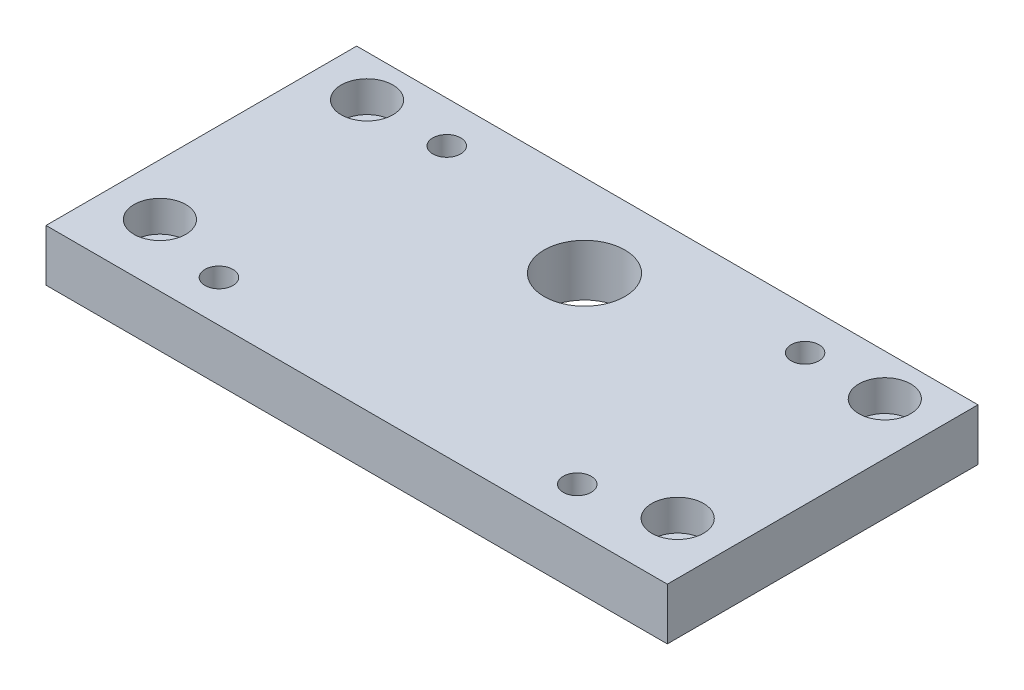
ISO-10303-21;
HEADER;
FILE_DESCRIPTION(('STEP AP214'),'2;1');
FILE_NAME('part.step','',(''),(''),'','','');
FILE_SCHEMA(('AUTOMOTIVE_DESIGN { 1 0 10303 214 1 1 1 1 }'));
ENDSEC;
DATA;
#1=APPLICATION_CONTEXT('core data for automotive mechanical design processes');
#2=APPLICATION_PROTOCOL_DEFINITION('international standard','automotive_design',2000,#1);
#3=PRODUCT_CONTEXT('',#1,'mechanical');
#4=PRODUCT('Part','Part','',(#3));
#5=PRODUCT_RELATED_PRODUCT_CATEGORY('part','',(#4));
#6=PRODUCT_DEFINITION_FORMATION('','',#4);
#7=PRODUCT_DEFINITION_CONTEXT('part definition',#1,'design');
#8=PRODUCT_DEFINITION('design','',#6,#7);
#9=PRODUCT_DEFINITION_SHAPE('','',#8);
#10=(LENGTH_UNIT() NAMED_UNIT(*) SI_UNIT(.MILLI.,.METRE.));
#11=(NAMED_UNIT(*) PLANE_ANGLE_UNIT() SI_UNIT($,.RADIAN.));
#12=(NAMED_UNIT(*) SI_UNIT($,.STERADIAN.) SOLID_ANGLE_UNIT());
#13=UNCERTAINTY_MEASURE_WITH_UNIT(LENGTH_MEASURE(1.E-05),#10,'distance_accuracy_value','');
#14=(GEOMETRIC_REPRESENTATION_CONTEXT(3) GLOBAL_UNCERTAINTY_ASSIGNED_CONTEXT((#13)) GLOBAL_UNIT_ASSIGNED_CONTEXT((#10,
#11,#12)) REPRESENTATION_CONTEXT('',''));
#15=CARTESIAN_POINT('',(0.,0.,0.));
#16=DIRECTION('',(0.,0.,1.));
#17=DIRECTION('',(1.,0.,0.));
#18=AXIS2_PLACEMENT_3D('',#15,#16,#17);
#19=CARTESIAN_POINT('',(5.,0.,-6.));
#20=DIRECTION('',(0.,1.,0.));
#21=DIRECTION('',(0.,0.,1.));
#22=AXIS2_PLACEMENT_3D('',#19,#20,#21);
#23=CYLINDRICAL_SURFACE('',#22,1.25);
#24=CARTESIAN_POINT('',(5.,0.,-6.));
#25=DIRECTION('',(0.,-1.,0.));
#26=DIRECTION('',(0.,0.,1.));
#27=AXIS2_PLACEMENT_3D('',#24,#25,#26);
#28=CIRCLE('',#27,1.25);
#29=CARTESIAN_POINT('',(5.,0.,-4.75));
#30=VERTEX_POINT('',#29);
#31=EDGE_CURVE('E118',#30,#30,#28,.T.);
#32=ORIENTED_EDGE('',*,*,#31,.T.);
#33=EDGE_LOOP('',(#32));
#34=FACE_BOUND('',#33,.T.);
#35=CARTESIAN_POINT('',(5.,2.,-6.));
#36=DIRECTION('',(0.,1.,0.));
#37=DIRECTION('',(0.,0.,1.));
#38=AXIS2_PLACEMENT_3D('',#35,#36,#37);
#39=CIRCLE('',#38,1.25);
#40=CARTESIAN_POINT('',(5.,2.,-4.75));
#41=VERTEX_POINT('',#40);
#42=EDGE_CURVE('E40',#41,#41,#39,.T.);
#43=ORIENTED_EDGE('',*,*,#42,.T.);
#44=EDGE_LOOP('',(#43));
#45=FACE_BOUND('',#44,.T.);
#46=ADVANCED_FACE('F36',(#34,#45),#23,.F.);
#47=CARTESIAN_POINT('',(5.,0.,-26.));
#48=DIRECTION('',(0.,1.,0.));
#49=DIRECTION('',(0.,0.,1.));
#50=AXIS2_PLACEMENT_3D('',#47,#48,#49);
#51=CYLINDRICAL_SURFACE('',#50,1.25);
#52=CARTESIAN_POINT('',(5.,0.,-26.));
#53=DIRECTION('',(0.,-1.,0.));
#54=DIRECTION('',(0.,0.,1.));
#55=AXIS2_PLACEMENT_3D('',#52,#53,#54);
#56=CIRCLE('',#55,1.25);
#57=CARTESIAN_POINT('',(5.,0.,-24.75));
#58=VERTEX_POINT('',#57);
#59=EDGE_CURVE('E150',#58,#58,#56,.T.);
#60=ORIENTED_EDGE('',*,*,#59,.T.);
#61=EDGE_LOOP('',(#60));
#62=FACE_BOUND('',#61,.T.);
#63=CARTESIAN_POINT('',(5.,2.,-26.));
#64=DIRECTION('',(0.,1.,0.));
#65=DIRECTION('',(0.,0.,1.));
#66=AXIS2_PLACEMENT_3D('',#63,#64,#65);
#67=CIRCLE('',#66,1.25);
#68=CARTESIAN_POINT('',(5.,2.,-24.75));
#69=VERTEX_POINT('',#68);
#70=EDGE_CURVE('E119',#69,#69,#67,.T.);
#71=ORIENTED_EDGE('',*,*,#70,.T.);
#72=EDGE_LOOP('',(#71));
#73=FACE_BOUND('',#72,.T.);
#74=ADVANCED_FACE('F208',(#62,#73),#51,.F.);
#75=CARTESIAN_POINT('',(55.,0.,-6.));
#76=DIRECTION('',(0.,1.,0.));
#77=DIRECTION('',(0.,0.,1.));
#78=AXIS2_PLACEMENT_3D('',#75,#76,#77);
#79=CYLINDRICAL_SURFACE('',#78,1.25);
#80=CARTESIAN_POINT('',(55.,0.,-6.));
#81=DIRECTION('',(0.,1.,0.));
#82=DIRECTION('',(0.,0.,1.));
#83=AXIS2_PLACEMENT_3D('',#80,#81,#82);
#84=CIRCLE('',#83,1.25);
#85=CARTESIAN_POINT('',(55.,0.,-4.75));
#86=VERTEX_POINT('',#85);
#87=EDGE_CURVE('E153',#86,#86,#84,.T.);
#88=ORIENTED_EDGE('',*,*,#87,.F.);
#89=EDGE_LOOP('',(#88));
#90=FACE_BOUND('',#89,.T.);
#91=CARTESIAN_POINT('',(55.,2.,-6.));
#92=DIRECTION('',(0.,1.,0.));
#93=DIRECTION('',(0.,0.,1.));
#94=AXIS2_PLACEMENT_3D('',#91,#92,#93);
#95=CIRCLE('',#94,1.25);
#96=CARTESIAN_POINT('',(55.,2.,-4.75));
#97=VERTEX_POINT('',#96);
#98=EDGE_CURVE('E115',#97,#97,#95,.F.);
#99=ORIENTED_EDGE('',*,*,#98,.F.);
#100=EDGE_LOOP('',(#99));
#101=FACE_BOUND('',#100,.T.);
#102=ADVANCED_FACE('F214',(#90,#101),#79,.F.);
#103=CARTESIAN_POINT('',(55.,0.,-26.));
#104=DIRECTION('',(0.,1.,0.));
#105=DIRECTION('',(0.,0.,1.));
#106=AXIS2_PLACEMENT_3D('',#103,#104,#105);
#107=CYLINDRICAL_SURFACE('',#106,1.25);
#108=CARTESIAN_POINT('',(55.,0.,-26.));
#109=DIRECTION('',(0.,1.,0.));
#110=DIRECTION('',(0.,0.,1.));
#111=AXIS2_PLACEMENT_3D('',#108,#109,#110);
#112=CIRCLE('',#111,1.25);
#113=CARTESIAN_POINT('',(55.,0.,-24.75));
#114=VERTEX_POINT('',#113);
#115=EDGE_CURVE('E156',#114,#114,#112,.T.);
#116=ORIENTED_EDGE('',*,*,#115,.F.);
#117=EDGE_LOOP('',(#116));
#118=FACE_BOUND('',#117,.T.);
#119=CARTESIAN_POINT('',(55.,2.,-26.));
#120=DIRECTION('',(0.,1.,0.));
#121=DIRECTION('',(0.,0.,1.));
#122=AXIS2_PLACEMENT_3D('',#119,#120,#121);
#123=CIRCLE('',#122,1.25);
#124=CARTESIAN_POINT('',(55.,2.,-24.75));
#125=VERTEX_POINT('',#124);
#126=EDGE_CURVE('E112',#125,#125,#123,.F.);
#127=ORIENTED_EDGE('',*,*,#126,.F.);
#128=EDGE_LOOP('',(#127));
#129=FACE_BOUND('',#128,.T.);
#130=ADVANCED_FACE('F220',(#118,#129),#107,.F.);
#131=CARTESIAN_POINT('',(0.,5.,0.));
#132=DIRECTION('',(1.,0.,0.));
#133=DIRECTION('',(0.,0.,-1.));
#134=AXIS2_PLACEMENT_3D('',#131,#132,#133);
#135=PLANE('',#134);
#136=DIRECTION('',(0.,0.,1.));
#137=VECTOR('',#136,1.);
#138=CARTESIAN_POINT('',(0.,0.,0.));
#139=LINE('',#138,#137);
#140=CARTESIAN_POINT('',(0.,0.,-30.));
#141=VERTEX_POINT('',#140);
#142=CARTESIAN_POINT('',(0.,0.,0.));
#143=VERTEX_POINT('',#142);
#144=EDGE_CURVE('E103',#141,#143,#139,.T.);
#145=ORIENTED_EDGE('',*,*,#144,.T.);
#146=DIRECTION('',(0.,-1.,0.));
#147=VECTOR('',#146,1.);
#148=CARTESIAN_POINT('',(0.,5.,0.));
#149=LINE('',#148,#147);
#150=CARTESIAN_POINT('',(0.,5.,0.));
#151=VERTEX_POINT('',#150);
#152=EDGE_CURVE('E11',#151,#143,#149,.T.);
#153=ORIENTED_EDGE('',*,*,#152,.F.);
#154=DIRECTION('',(0.,0.,1.));
#155=VECTOR('',#154,1.);
#156=CARTESIAN_POINT('',(0.,5.,0.));
#157=LINE('',#156,#155);
#158=CARTESIAN_POINT('',(0.,5.,-30.));
#159=VERTEX_POINT('',#158);
#160=EDGE_CURVE('E90',#159,#151,#157,.T.);
#161=ORIENTED_EDGE('',*,*,#160,.F.);
#162=DIRECTION('',(0.,-1.,0.));
#163=VECTOR('',#162,1.);
#164=CARTESIAN_POINT('',(0.,5.,-30.));
#165=LINE('',#164,#163);
#166=EDGE_CURVE('E99',#159,#141,#165,.T.);
#167=ORIENTED_EDGE('',*,*,#166,.T.);
#168=EDGE_LOOP('',(#145,#153,#161,#167));
#169=FACE_BOUND('',#168,.T.);
#170=ADVANCED_FACE('F38',(#169),#135,.F.);
#171=CARTESIAN_POINT('',(0.,5.,0.));
#172=DIRECTION('',(0.,0.,-1.));
#173=DIRECTION('',(-1.,0.,0.));
#174=AXIS2_PLACEMENT_3D('',#171,#172,#173);
#175=PLANE('',#174);
#176=DIRECTION('',(1.,0.,0.));
#177=VECTOR('',#176,1.);
#178=CARTESIAN_POINT('',(0.,0.,0.));
#179=LINE('',#178,#177);
#180=CARTESIAN_POINT('',(60.,0.,0.));
#181=VERTEX_POINT('',#180);
#182=EDGE_CURVE('E94',#143,#181,#179,.T.);
#183=ORIENTED_EDGE('',*,*,#182,.T.);
#184=DIRECTION('',(0.,-1.,0.));
#185=VECTOR('',#184,1.);
#186=CARTESIAN_POINT('',(60.,5.,0.));
#187=LINE('',#186,#185);
#188=CARTESIAN_POINT('',(60.,5.,0.));
#189=VERTEX_POINT('',#188);
#190=EDGE_CURVE('E46',#189,#181,#187,.T.);
#191=ORIENTED_EDGE('',*,*,#190,.F.);
#192=DIRECTION('',(1.,0.,0.));
#193=VECTOR('',#192,1.);
#194=CARTESIAN_POINT('',(0.,5.,0.));
#195=LINE('',#194,#193);
#196=EDGE_CURVE('E85',#151,#189,#195,.T.);
#197=ORIENTED_EDGE('',*,*,#196,.F.);
#198=ORIENTED_EDGE('',*,*,#152,.T.);
#199=EDGE_LOOP('',(#183,#191,#197,#198));
#200=FACE_BOUND('',#199,.T.);
#201=ADVANCED_FACE('F93',(#200),#175,.F.);
#202=CARTESIAN_POINT('',(60.,5.,0.));
#203=DIRECTION('',(-1.,0.,0.));
#204=DIRECTION('',(0.,0.,1.));
#205=AXIS2_PLACEMENT_3D('',#202,#203,#204);
#206=PLANE('',#205);
#207=DIRECTION('',(0.,0.,-1.));
#208=VECTOR('',#207,1.);
#209=CARTESIAN_POINT('',(60.,0.,0.));
#210=LINE('',#209,#208);
#211=CARTESIAN_POINT('',(60.,0.,-30.));
#212=VERTEX_POINT('',#211);
#213=EDGE_CURVE('E72',#181,#212,#210,.T.);
#214=ORIENTED_EDGE('',*,*,#213,.T.);
#215=DIRECTION('',(0.,-1.,0.));
#216=VECTOR('',#215,1.);
#217=CARTESIAN_POINT('',(60.,5.,-30.));
#218=LINE('',#217,#216);
#219=CARTESIAN_POINT('',(60.,5.,-30.));
#220=VERTEX_POINT('',#219);
#221=EDGE_CURVE('E95',#220,#212,#218,.T.);
#222=ORIENTED_EDGE('',*,*,#221,.F.);
#223=DIRECTION('',(0.,0.,-1.));
#224=VECTOR('',#223,1.);
#225=CARTESIAN_POINT('',(60.,5.,0.));
#226=LINE('',#225,#224);
#227=EDGE_CURVE('E88',#189,#220,#226,.T.);
#228=ORIENTED_EDGE('',*,*,#227,.F.);
#229=ORIENTED_EDGE('',*,*,#190,.T.);
#230=EDGE_LOOP('',(#214,#222,#228,#229));
#231=FACE_BOUND('',#230,.T.);
#232=ADVANCED_FACE('F97',(#231),#206,.F.);
#233=CARTESIAN_POINT('',(0.,5.,-30.));
#234=DIRECTION('',(0.,0.,1.));
#235=DIRECTION('',(1.,0.,0.));
#236=AXIS2_PLACEMENT_3D('',#233,#234,#235);
#237=PLANE('',#236);
#238=DIRECTION('',(-1.,0.,0.));
#239=VECTOR('',#238,1.);
#240=CARTESIAN_POINT('',(0.,0.,-30.));
#241=LINE('',#240,#239);
#242=EDGE_CURVE('E78',#212,#141,#241,.T.);
#243=ORIENTED_EDGE('',*,*,#242,.T.);
#244=ORIENTED_EDGE('',*,*,#166,.F.);
#245=DIRECTION('',(-1.,0.,0.));
#246=VECTOR('',#245,1.);
#247=CARTESIAN_POINT('',(0.,5.,-30.));
#248=LINE('',#247,#246);
#249=EDGE_CURVE('E55',#220,#159,#248,.T.);
#250=ORIENTED_EDGE('',*,*,#249,.F.);
#251=ORIENTED_EDGE('',*,*,#221,.T.);
#252=EDGE_LOOP('',(#243,#244,#250,#251));
#253=FACE_BOUND('',#252,.T.);
#254=ADVANCED_FACE('F195',(#253),#237,.F.);
#255=CARTESIAN_POINT('',(0.,5.,0.));
#256=DIRECTION('',(0.,-1.,0.));
#257=DIRECTION('',(0.,0.,-1.));
#258=AXIS2_PLACEMENT_3D('',#255,#256,#257);
#259=PLANE('',#258);
#260=CARTESIAN_POINT('',(5.,5.,-26.));
#261=DIRECTION('',(0.,-1.,0.));
#262=DIRECTION('',(0.,0.,1.));
#263=AXIS2_PLACEMENT_3D('',#260,#261,#262);
#264=CIRCLE('',#263,2.5);
#265=CARTESIAN_POINT('',(5.,5.,-23.5));
#266=VERTEX_POINT('',#265);
#267=EDGE_CURVE('E127',#266,#266,#264,.T.);
#268=ORIENTED_EDGE('',*,*,#267,.T.);
#269=EDGE_LOOP('',(#268));
#270=FACE_BOUND('',#269,.T.);
#271=CARTESIAN_POINT('',(5.,5.,-6.));
#272=DIRECTION('',(0.,-1.,0.));
#273=DIRECTION('',(0.,0.,1.));
#274=AXIS2_PLACEMENT_3D('',#271,#272,#273);
#275=CIRCLE('',#274,2.5);
#276=CARTESIAN_POINT('',(5.,5.,-3.5));
#277=VERTEX_POINT('',#276);
#278=EDGE_CURVE('E137',#277,#277,#275,.T.);
#279=ORIENTED_EDGE('',*,*,#278,.T.);
#280=EDGE_LOOP('',(#279));
#281=FACE_BOUND('',#280,.T.);
#282=CARTESIAN_POINT('',(55.,5.,-26.));
#283=DIRECTION('',(0.,1.,0.));
#284=DIRECTION('',(0.,0.,1.));
#285=AXIS2_PLACEMENT_3D('',#282,#283,#284);
#286=CIRCLE('',#285,2.5);
#287=CARTESIAN_POINT('',(55.,5.,-23.5));
#288=VERTEX_POINT('',#287);
#289=EDGE_CURVE('E142',#288,#288,#286,.T.);
#290=ORIENTED_EDGE('',*,*,#289,.F.);
#291=EDGE_LOOP('',(#290));
#292=FACE_BOUND('',#291,.T.);
#293=CARTESIAN_POINT('',(55.,5.,-6.));
#294=DIRECTION('',(0.,1.,0.));
#295=DIRECTION('',(0.,0.,1.));
#296=AXIS2_PLACEMENT_3D('',#293,#294,#295);
#297=CIRCLE('',#296,2.5);
#298=CARTESIAN_POINT('',(55.,5.,-3.5));
#299=VERTEX_POINT('',#298);
#300=EDGE_CURVE('E125',#299,#299,#297,.T.);
#301=ORIENTED_EDGE('',*,*,#300,.F.);
#302=EDGE_LOOP('',(#301));
#303=FACE_BOUND('',#302,.T.);
#304=CARTESIAN_POINT('',(12.7,5.,-4.));
#305=DIRECTION('',(0.,-1.,0.));
#306=DIRECTION('',(0.,0.,1.));
#307=AXIS2_PLACEMENT_3D('',#304,#305,#306);
#308=CIRCLE('',#307,1.35);
#309=CARTESIAN_POINT('',(12.7,5.,-2.65));
#310=VERTEX_POINT('',#309);
#311=EDGE_CURVE('E166',#310,#310,#308,.T.);
#312=ORIENTED_EDGE('',*,*,#311,.T.);
#313=EDGE_LOOP('',(#312));
#314=FACE_BOUND('',#313,.T.);
#315=CARTESIAN_POINT('',(12.7,5.,-26.));
#316=DIRECTION('',(0.,-1.,0.));
#317=DIRECTION('',(0.,0.,1.));
#318=AXIS2_PLACEMENT_3D('',#315,#316,#317);
#319=CIRCLE('',#318,1.35);
#320=CARTESIAN_POINT('',(12.7,5.,-24.65));
#321=VERTEX_POINT('',#320);
#322=EDGE_CURVE('E159',#321,#321,#319,.T.);
#323=ORIENTED_EDGE('',*,*,#322,.T.);
#324=EDGE_LOOP('',(#323));
#325=FACE_BOUND('',#324,.T.);
#326=CARTESIAN_POINT('',(30.,5.,-22.));
#327=DIRECTION('',(0.,1.,0.));
#328=DIRECTION('',(0.,0.,1.));
#329=AXIS2_PLACEMENT_3D('',#326,#327,#328);
#330=CIRCLE('',#329,3.9);
#331=CARTESIAN_POINT('',(30.,5.,-18.1));
#332=VERTEX_POINT('',#331);
#333=EDGE_CURVE('E176',#332,#332,#330,.T.);
#334=ORIENTED_EDGE('',*,*,#333,.F.);
#335=EDGE_LOOP('',(#334));
#336=FACE_BOUND('',#335,.T.);
#337=CARTESIAN_POINT('',(47.3,5.,-4.));
#338=DIRECTION('',(0.,1.,0.));
#339=DIRECTION('',(0.,0.,1.));
#340=AXIS2_PLACEMENT_3D('',#337,#338,#339);
#341=CIRCLE('',#340,1.35);
#342=CARTESIAN_POINT('',(47.3,5.,-2.65));
#343=VERTEX_POINT('',#342);
#344=EDGE_CURVE('E182',#343,#343,#341,.T.);
#345=ORIENTED_EDGE('',*,*,#344,.F.);
#346=EDGE_LOOP('',(#345));
#347=FACE_BOUND('',#346,.T.);
#348=CARTESIAN_POINT('',(47.3,5.,-26.));
#349=DIRECTION('',(0.,1.,0.));
#350=DIRECTION('',(0.,0.,1.));
#351=AXIS2_PLACEMENT_3D('',#348,#349,#350);
#352=CIRCLE('',#351,1.35);
#353=CARTESIAN_POINT('',(47.3,5.,-24.65));
#354=VERTEX_POINT('',#353);
#355=EDGE_CURVE('E165',#354,#354,#352,.T.);
#356=ORIENTED_EDGE('',*,*,#355,.F.);
#357=EDGE_LOOP('',(#356));
#358=FACE_BOUND('',#357,.T.);
#359=ORIENTED_EDGE('',*,*,#160,.T.);
#360=ORIENTED_EDGE('',*,*,#196,.T.);
#361=ORIENTED_EDGE('',*,*,#227,.T.);
#362=ORIENTED_EDGE('',*,*,#249,.T.);
#363=EDGE_LOOP('',(#359,#360,#361,#362));
#364=FACE_BOUND('',#363,.T.);
#365=ADVANCED_FACE('F86',(#270,#281,#292,#303,#314,#325,#336,#347,#358,#364),#259,.F.);
#366=CARTESIAN_POINT('',(0.,0.,0.));
#367=DIRECTION('',(0.,-1.,0.));
#368=DIRECTION('',(0.,0.,-1.));
#369=AXIS2_PLACEMENT_3D('',#366,#367,#368);
#370=PLANE('',#369);
#371=ORIENTED_EDGE('',*,*,#59,.F.);
#372=EDGE_LOOP('',(#371));
#373=FACE_BOUND('',#372,.T.);
#374=ORIENTED_EDGE('',*,*,#31,.F.);
#375=EDGE_LOOP('',(#374));
#376=FACE_BOUND('',#375,.T.);
#377=ORIENTED_EDGE('',*,*,#115,.T.);
#378=EDGE_LOOP('',(#377));
#379=FACE_BOUND('',#378,.T.);
#380=ORIENTED_EDGE('',*,*,#87,.T.);
#381=EDGE_LOOP('',(#380));
#382=FACE_BOUND('',#381,.T.);
#383=CARTESIAN_POINT('',(12.7,0.,-4.));
#384=DIRECTION('',(0.,-1.,0.));
#385=DIRECTION('',(0.,0.,1.));
#386=AXIS2_PLACEMENT_3D('',#383,#384,#385);
#387=CIRCLE('',#386,1.35);
#388=CARTESIAN_POINT('',(12.7,0.,-2.65));
#389=VERTEX_POINT('',#388);
#390=EDGE_CURVE('E162',#389,#389,#387,.T.);
#391=ORIENTED_EDGE('',*,*,#390,.F.);
#392=EDGE_LOOP('',(#391));
#393=FACE_BOUND('',#392,.T.);
#394=CARTESIAN_POINT('',(12.7,0.,-26.));
#395=DIRECTION('',(0.,-1.,0.));
#396=DIRECTION('',(0.,0.,1.));
#397=AXIS2_PLACEMENT_3D('',#394,#395,#396);
#398=CIRCLE('',#397,1.35);
#399=CARTESIAN_POINT('',(12.7,0.,-24.65));
#400=VERTEX_POINT('',#399);
#401=EDGE_CURVE('E169',#400,#400,#398,.T.);
#402=ORIENTED_EDGE('',*,*,#401,.F.);
#403=EDGE_LOOP('',(#402));
#404=FACE_BOUND('',#403,.T.);
#405=CARTESIAN_POINT('',(30.,0.,-22.));
#406=DIRECTION('',(0.,1.,0.));
#407=DIRECTION('',(0.,0.,1.));
#408=AXIS2_PLACEMENT_3D('',#405,#406,#407);
#409=CIRCLE('',#408,3.9);
#410=CARTESIAN_POINT('',(30.,0.,-18.1));
#411=VERTEX_POINT('',#410);
#412=EDGE_CURVE('E106',#411,#411,#409,.T.);
#413=ORIENTED_EDGE('',*,*,#412,.T.);
#414=EDGE_LOOP('',(#413));
#415=FACE_BOUND('',#414,.T.);
#416=CARTESIAN_POINT('',(47.3,0.,-4.));
#417=DIRECTION('',(0.,1.,0.));
#418=DIRECTION('',(0.,0.,1.));
#419=AXIS2_PLACEMENT_3D('',#416,#417,#418);
#420=CIRCLE('',#419,1.35);
#421=CARTESIAN_POINT('',(47.3,0.,-2.65));
#422=VERTEX_POINT('',#421);
#423=EDGE_CURVE('E179',#422,#422,#420,.T.);
#424=ORIENTED_EDGE('',*,*,#423,.T.);
#425=EDGE_LOOP('',(#424));
#426=FACE_BOUND('',#425,.T.);
#427=CARTESIAN_POINT('',(47.3,0.,-26.));
#428=DIRECTION('',(0.,1.,0.));
#429=DIRECTION('',(0.,0.,1.));
#430=AXIS2_PLACEMENT_3D('',#427,#428,#429);
#431=CIRCLE('',#430,1.35);
#432=CARTESIAN_POINT('',(47.3,0.,-24.65));
#433=VERTEX_POINT('',#432);
#434=EDGE_CURVE('E185',#433,#433,#431,.T.);
#435=ORIENTED_EDGE('',*,*,#434,.T.);
#436=EDGE_LOOP('',(#435));
#437=FACE_BOUND('',#436,.T.);
#438=ORIENTED_EDGE('',*,*,#144,.F.);
#439=ORIENTED_EDGE('',*,*,#242,.F.);
#440=ORIENTED_EDGE('',*,*,#213,.F.);
#441=ORIENTED_EDGE('',*,*,#182,.F.);
#442=EDGE_LOOP('',(#438,#439,#440,#441));
#443=FACE_BOUND('',#442,.T.);
#444=ADVANCED_FACE('F194',(#373,#376,#379,#382,#393,#404,#415,#426,#437,#443),#370,.T.);
#445=CARTESIAN_POINT('',(47.3,0.,-26.));
#446=DIRECTION('',(0.,1.,0.));
#447=DIRECTION('',(0.,0.,1.));
#448=AXIS2_PLACEMENT_3D('',#445,#446,#447);
#449=CYLINDRICAL_SURFACE('',#448,1.35);
#450=ORIENTED_EDGE('',*,*,#434,.F.);
#451=EDGE_LOOP('',(#450));
#452=FACE_BOUND('',#451,.T.);
#453=ORIENTED_EDGE('',*,*,#355,.T.);
#454=EDGE_LOOP('',(#453));
#455=FACE_BOUND('',#454,.T.);
#456=ADVANCED_FACE('F191',(#452,#455),#449,.F.);
#457=CARTESIAN_POINT('',(47.3,0.,-4.));
#458=DIRECTION('',(0.,1.,0.));
#459=DIRECTION('',(0.,0.,1.));
#460=AXIS2_PLACEMENT_3D('',#457,#458,#459);
#461=CYLINDRICAL_SURFACE('',#460,1.35);
#462=ORIENTED_EDGE('',*,*,#423,.F.);
#463=EDGE_LOOP('',(#462));
#464=FACE_BOUND('',#463,.T.);
#465=ORIENTED_EDGE('',*,*,#344,.T.);
#466=EDGE_LOOP('',(#465));
#467=FACE_BOUND('',#466,.T.);
#468=ADVANCED_FACE('F239',(#464,#467),#461,.F.);
#469=CARTESIAN_POINT('',(30.,0.,-22.));
#470=DIRECTION('',(0.,1.,0.));
#471=DIRECTION('',(0.,0.,1.));
#472=AXIS2_PLACEMENT_3D('',#469,#470,#471);
#473=CYLINDRICAL_SURFACE('',#472,3.9);
#474=ORIENTED_EDGE('',*,*,#412,.F.);
#475=EDGE_LOOP('',(#474));
#476=FACE_BOUND('',#475,.T.);
#477=ORIENTED_EDGE('',*,*,#333,.T.);
#478=EDGE_LOOP('',(#477));
#479=FACE_BOUND('',#478,.T.);
#480=ADVANCED_FACE('F235',(#476,#479),#473,.F.);
#481=CARTESIAN_POINT('',(12.7,0.,-26.));
#482=DIRECTION('',(0.,1.,0.));
#483=DIRECTION('',(0.,0.,1.));
#484=AXIS2_PLACEMENT_3D('',#481,#482,#483);
#485=CYLINDRICAL_SURFACE('',#484,1.35);
#486=ORIENTED_EDGE('',*,*,#401,.T.);
#487=EDGE_LOOP('',(#486));
#488=FACE_BOUND('',#487,.T.);
#489=ORIENTED_EDGE('',*,*,#322,.F.);
#490=EDGE_LOOP('',(#489));
#491=FACE_BOUND('',#490,.T.);
#492=ADVANCED_FACE('F231',(#488,#491),#485,.F.);
#493=CARTESIAN_POINT('',(12.7,0.,-4.));
#494=DIRECTION('',(0.,1.,0.));
#495=DIRECTION('',(0.,0.,1.));
#496=AXIS2_PLACEMENT_3D('',#493,#494,#495);
#497=CYLINDRICAL_SURFACE('',#496,1.35);
#498=ORIENTED_EDGE('',*,*,#390,.T.);
#499=EDGE_LOOP('',(#498));
#500=FACE_BOUND('',#499,.T.);
#501=ORIENTED_EDGE('',*,*,#311,.F.);
#502=EDGE_LOOP('',(#501));
#503=FACE_BOUND('',#502,.T.);
#504=ADVANCED_FACE('F227',(#500,#503),#497,.F.);
#505=CARTESIAN_POINT('',(55.,2.,-26.));
#506=DIRECTION('',(0.,1.,0.));
#507=DIRECTION('',(0.,0.,1.));
#508=AXIS2_PLACEMENT_3D('',#505,#506,#507);
#509=PLANE('',#508);
#510=CARTESIAN_POINT('',(55.,2.,-26.));
#511=DIRECTION('',(0.,1.,0.));
#512=DIRECTION('',(0.,0.,1.));
#513=AXIS2_PLACEMENT_3D('',#510,#511,#512);
#514=CIRCLE('',#513,2.5);
#515=CARTESIAN_POINT('',(55.,2.,-23.5));
#516=VERTEX_POINT('',#515);
#517=EDGE_CURVE('E116',#516,#516,#514,.T.);
#518=ORIENTED_EDGE('',*,*,#517,.T.);
#519=EDGE_LOOP('',(#518));
#520=FACE_BOUND('',#519,.T.);
#521=ORIENTED_EDGE('',*,*,#126,.T.);
#522=EDGE_LOOP('',(#521));
#523=FACE_BOUND('',#522,.T.);
#524=ADVANCED_FACE('F230',(#520,#523),#509,.T.);
#525=CARTESIAN_POINT('',(55.,2.,-26.));
#526=DIRECTION('',(0.,1.,0.));
#527=DIRECTION('',(0.,0.,1.));
#528=AXIS2_PLACEMENT_3D('',#525,#526,#527);
#529=CYLINDRICAL_SURFACE('',#528,2.5);
#530=ORIENTED_EDGE('',*,*,#517,.F.);
#531=EDGE_LOOP('',(#530));
#532=FACE_BOUND('',#531,.T.);
#533=ORIENTED_EDGE('',*,*,#289,.T.);
#534=EDGE_LOOP('',(#533));
#535=FACE_BOUND('',#534,.T.);
#536=ADVANCED_FACE('F322',(#532,#535),#529,.F.);
#537=CARTESIAN_POINT('',(55.,2.,-6.));
#538=DIRECTION('',(0.,1.,0.));
#539=DIRECTION('',(0.,0.,1.));
#540=AXIS2_PLACEMENT_3D('',#537,#538,#539);
#541=PLANE('',#540);
#542=CARTESIAN_POINT('',(55.,2.,-6.));
#543=DIRECTION('',(0.,1.,0.));
#544=DIRECTION('',(0.,0.,1.));
#545=AXIS2_PLACEMENT_3D('',#542,#543,#544);
#546=CIRCLE('',#545,2.5);
#547=CARTESIAN_POINT('',(55.,2.,-3.5));
#548=VERTEX_POINT('',#547);
#549=EDGE_CURVE('E145',#548,#548,#546,.T.);
#550=ORIENTED_EDGE('',*,*,#549,.T.);
#551=EDGE_LOOP('',(#550));
#552=FACE_BOUND('',#551,.T.);
#553=ORIENTED_EDGE('',*,*,#98,.T.);
#554=EDGE_LOOP('',(#553));
#555=FACE_BOUND('',#554,.T.);
#556=ADVANCED_FACE('F332',(#552,#555),#541,.T.);
#557=CARTESIAN_POINT('',(55.,2.,-6.));
#558=DIRECTION('',(0.,1.,0.));
#559=DIRECTION('',(0.,0.,1.));
#560=AXIS2_PLACEMENT_3D('',#557,#558,#559);
#561=CYLINDRICAL_SURFACE('',#560,2.5);
#562=ORIENTED_EDGE('',*,*,#549,.F.);
#563=EDGE_LOOP('',(#562));
#564=FACE_BOUND('',#563,.T.);
#565=ORIENTED_EDGE('',*,*,#300,.T.);
#566=EDGE_LOOP('',(#565));
#567=FACE_BOUND('',#566,.T.);
#568=ADVANCED_FACE('F342',(#564,#567),#561,.F.);
#569=CARTESIAN_POINT('',(5.,2.,-26.));
#570=DIRECTION('',(0.,1.,0.));
#571=DIRECTION('',(0.,0.,1.));
#572=AXIS2_PLACEMENT_3D('',#569,#570,#571);
#573=CYLINDRICAL_SURFACE('',#572,2.5);
#574=CARTESIAN_POINT('',(5.,2.,-26.));
#575=DIRECTION('',(0.,-1.,0.));
#576=DIRECTION('',(0.,0.,1.));
#577=AXIS2_PLACEMENT_3D('',#574,#575,#576);
#578=CIRCLE('',#577,2.5);
#579=CARTESIAN_POINT('',(5.,2.,-23.5));
#580=VERTEX_POINT('',#579);
#581=EDGE_CURVE('E121',#580,#580,#578,.T.);
#582=ORIENTED_EDGE('',*,*,#581,.T.);
#583=EDGE_LOOP('',(#582));
#584=FACE_BOUND('',#583,.T.);
#585=ORIENTED_EDGE('',*,*,#267,.F.);
#586=EDGE_LOOP('',(#585));
#587=FACE_BOUND('',#586,.T.);
#588=ADVANCED_FACE('F351',(#584,#587),#573,.F.);
#589=CARTESIAN_POINT('',(5.,2.,-26.));
#590=DIRECTION('',(0.,1.,0.));
#591=DIRECTION('',(0.,0.,1.));
#592=AXIS2_PLACEMENT_3D('',#589,#590,#591);
#593=PLANE('',#592);
#594=ORIENTED_EDGE('',*,*,#70,.F.);
#595=EDGE_LOOP('',(#594));
#596=FACE_BOUND('',#595,.T.);
#597=ORIENTED_EDGE('',*,*,#581,.F.);
#598=EDGE_LOOP('',(#597));
#599=FACE_BOUND('',#598,.T.);
#600=ADVANCED_FACE('F374',(#596,#599),#593,.T.);
#601=CARTESIAN_POINT('',(5.,2.,-6.));
#602=DIRECTION('',(0.,1.,0.));
#603=DIRECTION('',(0.,0.,1.));
#604=AXIS2_PLACEMENT_3D('',#601,#602,#603);
#605=CYLINDRICAL_SURFACE('',#604,2.5);
#606=CARTESIAN_POINT('',(5.,2.,-6.));
#607=DIRECTION('',(0.,-1.,0.));
#608=DIRECTION('',(0.,0.,1.));
#609=AXIS2_PLACEMENT_3D('',#606,#607,#608);
#610=CIRCLE('',#609,2.5);
#611=CARTESIAN_POINT('',(5.,2.,-3.5));
#612=VERTEX_POINT('',#611);
#613=EDGE_CURVE('E132',#612,#612,#610,.T.);
#614=ORIENTED_EDGE('',*,*,#613,.T.);
#615=EDGE_LOOP('',(#614));
#616=FACE_BOUND('',#615,.T.);
#617=ORIENTED_EDGE('',*,*,#278,.F.);
#618=EDGE_LOOP('',(#617));
#619=FACE_BOUND('',#618,.T.);
#620=ADVANCED_FACE('F383',(#616,#619),#605,.F.);
#621=CARTESIAN_POINT('',(5.,2.,-6.));
#622=DIRECTION('',(0.,1.,0.));
#623=DIRECTION('',(0.,0.,1.));
#624=AXIS2_PLACEMENT_3D('',#621,#622,#623);
#625=PLANE('',#624);
#626=ORIENTED_EDGE('',*,*,#42,.F.);
#627=EDGE_LOOP('',(#626));
#628=FACE_BOUND('',#627,.T.);
#629=ORIENTED_EDGE('',*,*,#613,.F.);
#630=EDGE_LOOP('',(#629));
#631=FACE_BOUND('',#630,.T.);
#632=ADVANCED_FACE('F393',(#628,#631),#625,.T.);
#633=CLOSED_SHELL('',(#46,#74,#102,#130,#170,#201,#232,#254,#365,#444,#456,#468,#480,#492,#504,
#524,#536,#556,#568,#588,#600,#620,#632));
#634=MANIFOLD_SOLID_BREP('B2',#633);
#635=ADVANCED_BREP_SHAPE_REPRESENTATION('',(#18,#634),#14);
#636=SHAPE_DEFINITION_REPRESENTATION(#9,#635);
ENDSEC;
END-ISO-10303-21;
